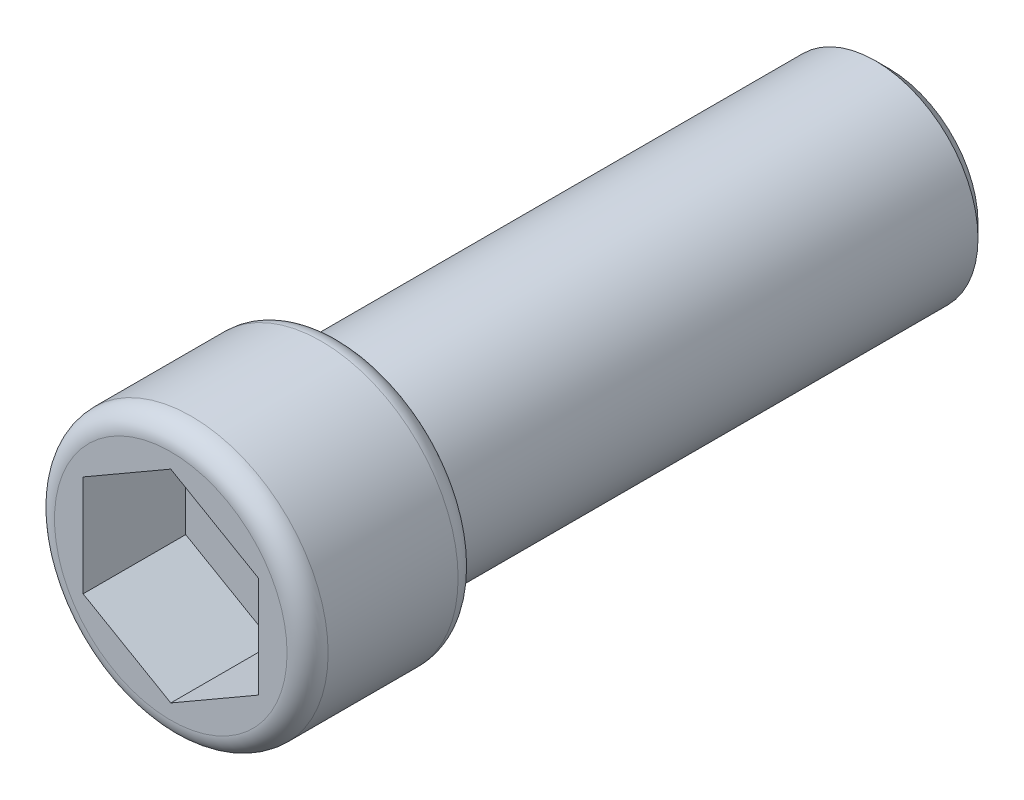
ISO-10303-21;
HEADER;
FILE_DESCRIPTION(('STEP AP214'),'2;1');
FILE_NAME('part.step','',(''),(''),'','','');
FILE_SCHEMA(('AUTOMOTIVE_DESIGN { 1 0 10303 214 1 1 1 1 }'));
ENDSEC;
DATA;
#1=APPLICATION_CONTEXT('core data for automotive mechanical design processes');
#2=APPLICATION_PROTOCOL_DEFINITION('international standard','automotive_design',2000,#1);
#3=PRODUCT_CONTEXT('',#1,'mechanical');
#4=PRODUCT('Part','Part','',(#3));
#5=PRODUCT_RELATED_PRODUCT_CATEGORY('part','',(#4));
#6=PRODUCT_DEFINITION_FORMATION('','',#4);
#7=PRODUCT_DEFINITION_CONTEXT('part definition',#1,'design');
#8=PRODUCT_DEFINITION('design','',#6,#7);
#9=PRODUCT_DEFINITION_SHAPE('','',#8);
#10=(LENGTH_UNIT() NAMED_UNIT(*) SI_UNIT(.MILLI.,.METRE.));
#11=(NAMED_UNIT(*) PLANE_ANGLE_UNIT() SI_UNIT($,.RADIAN.));
#12=(NAMED_UNIT(*) SI_UNIT($,.STERADIAN.) SOLID_ANGLE_UNIT());
#13=UNCERTAINTY_MEASURE_WITH_UNIT(LENGTH_MEASURE(1.E-05),#10,'distance_accuracy_value','');
#14=(GEOMETRIC_REPRESENTATION_CONTEXT(3) GLOBAL_UNCERTAINTY_ASSIGNED_CONTEXT((#13)) GLOBAL_UNIT_ASSIGNED_CONTEXT((#10,
#11,#12)) REPRESENTATION_CONTEXT('',''));
#15=CARTESIAN_POINT('',(0.,0.,0.));
#16=DIRECTION('',(0.,0.,1.));
#17=DIRECTION('',(1.,0.,0.));
#18=AXIS2_PLACEMENT_3D('',#15,#16,#17);
#19=CARTESIAN_POINT('',(0.,0.,8.));
#20=DIRECTION('',(0.,0.,-1.));
#21=DIRECTION('',(-1.,0.,0.));
#22=AXIS2_PLACEMENT_3D('',#19,#20,#21);
#23=CYLINDRICAL_SURFACE('',#22,1.5);
#24=CARTESIAN_POINT('',(0.,0.,0.2));
#25=DIRECTION('',(0.,0.,1.));
#26=DIRECTION('',(1.,0.,0.));
#27=AXIS2_PLACEMENT_3D('',#24,#25,#26);
#28=CIRCLE('',#27,1.5);
#29=CARTESIAN_POINT('',(1.5,0.,0.2));
#30=VERTEX_POINT('',#29);
#31=EDGE_CURVE('E50',#30,#30,#28,.T.);
#32=ORIENTED_EDGE('',*,*,#31,.T.);
#33=EDGE_LOOP('',(#32));
#34=FACE_BOUND('',#33,.T.);
#35=CARTESIAN_POINT('',(0.,0.,8.));
#36=DIRECTION('',(0.,0.,1.));
#37=DIRECTION('',(1.,0.,0.));
#38=AXIS2_PLACEMENT_3D('',#35,#36,#37);
#39=CIRCLE('',#38,1.5);
#40=CARTESIAN_POINT('',(1.5,0.,8.));
#41=VERTEX_POINT('',#40);
#42=EDGE_CURVE('E156',#41,#41,#39,.T.);
#43=ORIENTED_EDGE('',*,*,#42,.F.);
#44=EDGE_LOOP('',(#43));
#45=FACE_BOUND('',#44,.T.);
#46=ADVANCED_FACE('F41',(#34,#45),#23,.T.);
#47=CARTESIAN_POINT('',(0.,0.,0.));
#48=DIRECTION('',(0.,0.,1.));
#49=DIRECTION('',(1.,0.,0.));
#50=AXIS2_PLACEMENT_3D('',#47,#48,#49);
#51=PLANE('',#50);
#52=CARTESIAN_POINT('',(0.,0.,0.));
#53=DIRECTION('',(0.,0.,1.));
#54=DIRECTION('',(1.,0.,0.));
#55=AXIS2_PLACEMENT_3D('',#52,#53,#54);
#56=CIRCLE('',#55,1.3);
#57=CARTESIAN_POINT('',(1.3,0.,0.));
#58=VERTEX_POINT('',#57);
#59=EDGE_CURVE('E11',#58,#58,#56,.F.);
#60=ORIENTED_EDGE('',*,*,#59,.T.);
#61=EDGE_LOOP('',(#60));
#62=FACE_BOUND('',#61,.T.);
#63=ADVANCED_FACE('F200',(#62),#51,.F.);
#64=CARTESIAN_POINT('',(0.,0.,10.5));
#65=DIRECTION('',(0.,0.,-1.));
#66=DIRECTION('',(-1.,0.,0.));
#67=AXIS2_PLACEMENT_3D('',#64,#65,#66);
#68=CYLINDRICAL_SURFACE('',#67,2.);
#69=CARTESIAN_POINT('',(0.,0.,8.3));
#70=DIRECTION('',(0.,0.,1.));
#71=DIRECTION('',(1.,0.,0.));
#72=AXIS2_PLACEMENT_3D('',#69,#70,#71);
#73=CIRCLE('',#72,2.);
#74=CARTESIAN_POINT('',(2.,0.,8.3));
#75=VERTEX_POINT('',#74);
#76=EDGE_CURVE('E173',#75,#75,#73,.T.);
#77=ORIENTED_EDGE('',*,*,#76,.T.);
#78=EDGE_LOOP('',(#77));
#79=FACE_BOUND('',#78,.T.);
#80=CARTESIAN_POINT('',(0.,0.,10.2));
#81=DIRECTION('',(0.,0.,1.));
#82=DIRECTION('',(1.,0.,0.));
#83=AXIS2_PLACEMENT_3D('',#80,#81,#82);
#84=CIRCLE('',#83,2.);
#85=CARTESIAN_POINT('',(2.,0.,10.2));
#86=VERTEX_POINT('',#85);
#87=EDGE_CURVE('E169',#86,#86,#84,.F.);
#88=ORIENTED_EDGE('',*,*,#87,.T.);
#89=EDGE_LOOP('',(#88));
#90=FACE_BOUND('',#89,.T.);
#91=ADVANCED_FACE('F205',(#79,#90),#68,.T.);
#92=CARTESIAN_POINT('',(0.,0.,10.5));
#93=DIRECTION('',(0.,0.,1.));
#94=DIRECTION('',(1.,0.,0.));
#95=AXIS2_PLACEMENT_3D('',#92,#93,#94);
#96=PLANE('',#95);
#97=CARTESIAN_POINT('',(0.,0.,10.5));
#98=DIRECTION('',(0.,0.,1.));
#99=DIRECTION('',(1.,0.,0.));
#100=AXIS2_PLACEMENT_3D('',#97,#98,#99);
#101=CIRCLE('',#100,1.7);
#102=CARTESIAN_POINT('',(1.7,0.,10.5));
#103=VERTEX_POINT('',#102);
#104=EDGE_CURVE('E181',#103,#103,#101,.T.);
#105=ORIENTED_EDGE('',*,*,#104,.T.);
#106=EDGE_LOOP('',(#105));
#107=FACE_BOUND('',#106,.T.);
#108=DIRECTION('',(-0.866025403784442,0.499999999999995,0.));
#109=VECTOR('',#108,1.);
#110=CARTESIAN_POINT('',(1.28177031464721,0.740030436200855,10.5));
#111=LINE('',#110,#109);
#112=CARTESIAN_POINT('',(1.28177031464721,0.740030436200855,10.5));
#113=VERTEX_POINT('',#112);
#114=CARTESIAN_POINT('',(0.,1.48006087240168,10.5));
#115=VERTEX_POINT('',#114);
#116=EDGE_CURVE('E57',#113,#115,#111,.T.);
#117=ORIENTED_EDGE('',*,*,#116,.F.);
#118=DIRECTION('',(0.,1.,0.));
#119=VECTOR('',#118,1.);
#120=CARTESIAN_POINT('',(1.28177031464722,-0.740030436200828,10.5));
#121=LINE('',#120,#119);
#122=CARTESIAN_POINT('',(1.28177031464722,-0.740030436200828,10.5));
#123=VERTEX_POINT('',#122);
#124=EDGE_CURVE('E150',#123,#113,#121,.T.);
#125=ORIENTED_EDGE('',*,*,#124,.F.);
#126=DIRECTION('',(0.866025403784435,0.500000000000007,0.));
#127=VECTOR('',#126,1.);
#128=CARTESIAN_POINT('',(0.,-1.48006087240168,10.5));
#129=LINE('',#128,#127);
#130=CARTESIAN_POINT('',(0.,-1.48006087240168,10.5));
#131=VERTEX_POINT('',#130);
#132=EDGE_CURVE('E147',#131,#123,#129,.T.);
#133=ORIENTED_EDGE('',*,*,#132,.F.);
#134=DIRECTION('',(0.866025403784442,-0.499999999999995,0.));
#135=VECTOR('',#134,1.);
#136=CARTESIAN_POINT('',(-1.28177031464721,-0.740030436200846,10.5));
#137=LINE('',#136,#135);
#138=CARTESIAN_POINT('',(-1.28177031464721,-0.740030436200846,10.5));
#139=VERTEX_POINT('',#138);
#140=EDGE_CURVE('E105',#139,#131,#137,.T.);
#141=ORIENTED_EDGE('',*,*,#140,.F.);
#142=DIRECTION('',(0.,-1.,0.));
#143=VECTOR('',#142,1.);
#144=CARTESIAN_POINT('',(-1.28177031464722,0.740030436200837,10.5));
#145=LINE('',#144,#143);
#146=CARTESIAN_POINT('',(-1.28177031464722,0.740030436200837,10.5));
#147=VERTEX_POINT('',#146);
#148=EDGE_CURVE('E141',#147,#139,#145,.T.);
#149=ORIENTED_EDGE('',*,*,#148,.F.);
#150=DIRECTION('',(-0.866025403784438,-0.500000000000001,0.));
#151=VECTOR('',#150,1.);
#152=CARTESIAN_POINT('',(0.,1.48006087240168,10.5));
#153=LINE('',#152,#151);
#154=EDGE_CURVE('E137',#115,#147,#153,.T.);
#155=ORIENTED_EDGE('',*,*,#154,.F.);
#156=EDGE_LOOP('',(#117,#125,#133,#141,#149,#155));
#157=FACE_BOUND('',#156,.T.);
#158=ADVANCED_FACE('F223',(#107,#157),#96,.T.);
#159=CARTESIAN_POINT('',(0.,0.,8.));
#160=DIRECTION('',(0.,0.,1.));
#161=DIRECTION('',(1.,0.,0.));
#162=AXIS2_PLACEMENT_3D('',#159,#160,#161);
#163=PLANE('',#162);
#164=CARTESIAN_POINT('',(0.,0.,8.));
#165=DIRECTION('',(0.,0.,1.));
#166=DIRECTION('',(1.,0.,0.));
#167=AXIS2_PLACEMENT_3D('',#164,#165,#166);
#168=CIRCLE('',#167,1.7);
#169=CARTESIAN_POINT('',(1.7,0.,8.));
#170=VERTEX_POINT('',#169);
#171=EDGE_CURVE('E177',#170,#170,#168,.F.);
#172=ORIENTED_EDGE('',*,*,#171,.T.);
#173=EDGE_LOOP('',(#172));
#174=FACE_BOUND('',#173,.T.);
#175=ORIENTED_EDGE('',*,*,#42,.T.);
#176=EDGE_LOOP('',(#175));
#177=FACE_BOUND('',#176,.T.);
#178=ADVANCED_FACE('F230',(#174,#177),#163,.F.);
#179=CARTESIAN_POINT('',(1.28177031464721,0.740030436200855,9.));
#180=DIRECTION('',(0.499999999999995,0.866025403784441,0.));
#181=DIRECTION('',(-0.866025403784442,0.499999999999995,0.));
#182=AXIS2_PLACEMENT_3D('',#179,#180,#181);
#183=PLANE('',#182);
#184=ORIENTED_EDGE('',*,*,#116,.T.);
#185=DIRECTION('',(0.,0.,1.));
#186=VECTOR('',#185,1.);
#187=CARTESIAN_POINT('',(0.,1.48006087240168,9.));
#188=LINE('',#187,#186);
#189=CARTESIAN_POINT('',(0.,1.48006087240168,9.));
#190=VERTEX_POINT('',#189);
#191=EDGE_CURVE('E87',#190,#115,#188,.T.);
#192=ORIENTED_EDGE('',*,*,#191,.F.);
#193=DIRECTION('',(-0.866025403784442,0.499999999999995,0.));
#194=VECTOR('',#193,1.);
#195=CARTESIAN_POINT('',(1.28177031464721,0.740030436200855,9.));
#196=LINE('',#195,#194);
#197=CARTESIAN_POINT('',(1.28177031464721,0.740030436200855,9.));
#198=VERTEX_POINT('',#197);
#199=EDGE_CURVE('E153',#198,#190,#196,.T.);
#200=ORIENTED_EDGE('',*,*,#199,.F.);
#201=DIRECTION('',(0.,0.,1.));
#202=VECTOR('',#201,1.);
#203=CARTESIAN_POINT('',(1.28177031464721,0.740030436200855,9.));
#204=LINE('',#203,#202);
#205=EDGE_CURVE('E65',#198,#113,#204,.T.);
#206=ORIENTED_EDGE('',*,*,#205,.T.);
#207=EDGE_LOOP('',(#184,#192,#200,#206));
#208=FACE_BOUND('',#207,.T.);
#209=ADVANCED_FACE('F239',(#208),#183,.F.);
#210=CARTESIAN_POINT('',(1.28177031464722,-0.740030436200828,9.));
#211=DIRECTION('',(1.,0.,0.));
#212=DIRECTION('',(0.,1.,0.));
#213=AXIS2_PLACEMENT_3D('',#210,#211,#212);
#214=PLANE('',#213);
#215=ORIENTED_EDGE('',*,*,#124,.T.);
#216=ORIENTED_EDGE('',*,*,#205,.F.);
#217=DIRECTION('',(0.,1.,0.));
#218=VECTOR('',#217,1.);
#219=CARTESIAN_POINT('',(1.28177031464722,-0.740030436200828,9.));
#220=LINE('',#219,#218);
#221=CARTESIAN_POINT('',(1.28177031464722,-0.740030436200828,9.));
#222=VERTEX_POINT('',#221);
#223=EDGE_CURVE('E119',#222,#198,#220,.T.);
#224=ORIENTED_EDGE('',*,*,#223,.F.);
#225=DIRECTION('',(0.,0.,1.));
#226=VECTOR('',#225,1.);
#227=CARTESIAN_POINT('',(1.28177031464722,-0.740030436200828,9.));
#228=LINE('',#227,#226);
#229=EDGE_CURVE('E110',#222,#123,#228,.T.);
#230=ORIENTED_EDGE('',*,*,#229,.T.);
#231=EDGE_LOOP('',(#215,#216,#224,#230));
#232=FACE_BOUND('',#231,.T.);
#233=ADVANCED_FACE('F241',(#232),#214,.F.);
#234=CARTESIAN_POINT('',(0.,-1.48006087240168,9.));
#235=DIRECTION('',(0.500000000000007,-0.866025403784434,0.));
#236=DIRECTION('',(0.866025403784435,0.500000000000007,0.));
#237=AXIS2_PLACEMENT_3D('',#234,#235,#236);
#238=PLANE('',#237);
#239=ORIENTED_EDGE('',*,*,#132,.T.);
#240=ORIENTED_EDGE('',*,*,#229,.F.);
#241=DIRECTION('',(0.866025403784435,0.500000000000007,0.));
#242=VECTOR('',#241,1.);
#243=CARTESIAN_POINT('',(0.,-1.48006087240168,9.));
#244=LINE('',#243,#242);
#245=CARTESIAN_POINT('',(0.,-1.48006087240168,9.));
#246=VERTEX_POINT('',#245);
#247=EDGE_CURVE('E114',#246,#222,#244,.T.);
#248=ORIENTED_EDGE('',*,*,#247,.F.);
#249=DIRECTION('',(0.,0.,1.));
#250=VECTOR('',#249,1.);
#251=CARTESIAN_POINT('',(0.,-1.48006087240168,9.));
#252=LINE('',#251,#250);
#253=EDGE_CURVE('E98',#246,#131,#252,.T.);
#254=ORIENTED_EDGE('',*,*,#253,.T.);
#255=EDGE_LOOP('',(#239,#240,#248,#254));
#256=FACE_BOUND('',#255,.T.);
#257=ADVANCED_FACE('F115',(#256),#238,.F.);
#258=CARTESIAN_POINT('',(-1.28177031464721,-0.740030436200846,9.));
#259=DIRECTION('',(-0.499999999999995,-0.866025403784441,0.));
#260=DIRECTION('',(0.866025403784442,-0.499999999999995,0.));
#261=AXIS2_PLACEMENT_3D('',#258,#259,#260);
#262=PLANE('',#261);
#263=ORIENTED_EDGE('',*,*,#140,.T.);
#264=ORIENTED_EDGE('',*,*,#253,.F.);
#265=DIRECTION('',(0.866025403784442,-0.499999999999995,0.));
#266=VECTOR('',#265,1.);
#267=CARTESIAN_POINT('',(-1.28177031464721,-0.740030436200846,9.));
#268=LINE('',#267,#266);
#269=CARTESIAN_POINT('',(-1.28177031464721,-0.740030436200846,9.));
#270=VERTEX_POINT('',#269);
#271=EDGE_CURVE('E102',#270,#246,#268,.T.);
#272=ORIENTED_EDGE('',*,*,#271,.F.);
#273=DIRECTION('',(0.,0.,1.));
#274=VECTOR('',#273,1.);
#275=CARTESIAN_POINT('',(-1.28177031464721,-0.740030436200846,9.));
#276=LINE('',#275,#274);
#277=EDGE_CURVE('E111',#270,#139,#276,.T.);
#278=ORIENTED_EDGE('',*,*,#277,.T.);
#279=EDGE_LOOP('',(#263,#264,#272,#278));
#280=FACE_BOUND('',#279,.T.);
#281=ADVANCED_FACE('F100',(#280),#262,.F.);
#282=CARTESIAN_POINT('',(-1.28177031464722,0.740030436200837,9.));
#283=DIRECTION('',(-1.,0.,0.));
#284=DIRECTION('',(0.,-1.,0.));
#285=AXIS2_PLACEMENT_3D('',#282,#283,#284);
#286=PLANE('',#285);
#287=ORIENTED_EDGE('',*,*,#148,.T.);
#288=ORIENTED_EDGE('',*,*,#277,.F.);
#289=DIRECTION('',(0.,-1.,0.));
#290=VECTOR('',#289,1.);
#291=CARTESIAN_POINT('',(-1.28177031464722,0.740030436200837,9.));
#292=LINE('',#291,#290);
#293=CARTESIAN_POINT('',(-1.28177031464722,0.740030436200837,9.));
#294=VERTEX_POINT('',#293);
#295=EDGE_CURVE('E125',#294,#270,#292,.T.);
#296=ORIENTED_EDGE('',*,*,#295,.F.);
#297=DIRECTION('',(0.,0.,1.));
#298=VECTOR('',#297,1.);
#299=CARTESIAN_POINT('',(-1.28177031464722,0.740030436200837,9.));
#300=LINE('',#299,#298);
#301=EDGE_CURVE('E161',#294,#147,#300,.T.);
#302=ORIENTED_EDGE('',*,*,#301,.T.);
#303=EDGE_LOOP('',(#287,#288,#296,#302));
#304=FACE_BOUND('',#303,.T.);
#305=ADVANCED_FACE('F253',(#304),#286,.F.);
#306=CARTESIAN_POINT('',(0.,1.48006087240168,9.));
#307=DIRECTION('',(-0.500000000000001,0.866025403784438,0.));
#308=DIRECTION('',(-0.866025403784438,-0.500000000000001,0.));
#309=AXIS2_PLACEMENT_3D('',#306,#307,#308);
#310=PLANE('',#309);
#311=ORIENTED_EDGE('',*,*,#154,.T.);
#312=ORIENTED_EDGE('',*,*,#301,.F.);
#313=DIRECTION('',(-0.866025403784438,-0.500000000000001,0.));
#314=VECTOR('',#313,1.);
#315=CARTESIAN_POINT('',(0.,1.48006087240168,9.));
#316=LINE('',#315,#314);
#317=EDGE_CURVE('E129',#190,#294,#316,.T.);
#318=ORIENTED_EDGE('',*,*,#317,.F.);
#319=ORIENTED_EDGE('',*,*,#191,.T.);
#320=EDGE_LOOP('',(#311,#312,#318,#319));
#321=FACE_BOUND('',#320,.T.);
#322=ADVANCED_FACE('F215',(#321),#310,.F.);
#323=CARTESIAN_POINT('',(0.,0.,9.));
#324=DIRECTION('',(0.,0.,1.));
#325=DIRECTION('',(1.,0.,0.));
#326=AXIS2_PLACEMENT_3D('',#323,#324,#325);
#327=PLANE('',#326);
#328=ORIENTED_EDGE('',*,*,#199,.T.);
#329=ORIENTED_EDGE('',*,*,#317,.T.);
#330=ORIENTED_EDGE('',*,*,#295,.T.);
#331=ORIENTED_EDGE('',*,*,#271,.T.);
#332=ORIENTED_EDGE('',*,*,#247,.T.);
#333=ORIENTED_EDGE('',*,*,#223,.T.);
#334=EDGE_LOOP('',(#328,#329,#330,#331,#332,#333));
#335=FACE_BOUND('',#334,.T.);
#336=ADVANCED_FACE('F122',(#335),#327,.T.);
#337=CARTESIAN_POINT('',(0.,0.,8.3));
#338=DIRECTION('',(0.,0.,1.));
#339=DIRECTION('',(1.,0.,0.));
#340=AXIS2_PLACEMENT_3D('',#337,#338,#339);
#341=TOROIDAL_SURFACE('',#340,1.7,0.3);
#342=ORIENTED_EDGE('',*,*,#171,.F.);
#343=EDGE_LOOP('',(#342));
#344=FACE_BOUND('',#343,.T.);
#345=ORIENTED_EDGE('',*,*,#76,.F.);
#346=EDGE_LOOP('',(#345));
#347=FACE_BOUND('',#346,.T.);
#348=ADVANCED_FACE('F196',(#344,#347),#341,.T.);
#349=CARTESIAN_POINT('',(0.,0.,10.2));
#350=DIRECTION('',(0.,0.,1.));
#351=DIRECTION('',(1.,0.,0.));
#352=AXIS2_PLACEMENT_3D('',#349,#350,#351);
#353=TOROIDAL_SURFACE('',#352,1.7,0.3);
#354=ORIENTED_EDGE('',*,*,#87,.F.);
#355=EDGE_LOOP('',(#354));
#356=FACE_BOUND('',#355,.T.);
#357=ORIENTED_EDGE('',*,*,#104,.F.);
#358=EDGE_LOOP('',(#357));
#359=FACE_BOUND('',#358,.T.);
#360=ADVANCED_FACE('F191',(#356,#359),#353,.T.);
#361=CARTESIAN_POINT('',(0.,0.,0.2));
#362=DIRECTION('',(0.,0.,1.));
#363=DIRECTION('',(1.,0.,0.));
#364=AXIS2_PLACEMENT_3D('',#361,#362,#363);
#365=CONICAL_SURFACE('',#364,1.5,0.78539816339745);
#366=ORIENTED_EDGE('',*,*,#59,.F.);
#367=EDGE_LOOP('',(#366));
#368=FACE_BOUND('',#367,.T.);
#369=ORIENTED_EDGE('',*,*,#31,.F.);
#370=EDGE_LOOP('',(#369));
#371=FACE_BOUND('',#370,.T.);
#372=ADVANCED_FACE('F43',(#368,#371),#365,.T.);
#373=CLOSED_SHELL('',(#46,#63,#91,#158,#178,#209,#233,#257,#281,#305,#322,#336,#348,#360,#372));
#374=MANIFOLD_SOLID_BREP('B2',#373);
#375=ADVANCED_BREP_SHAPE_REPRESENTATION('',(#18,#374),#14);
#376=SHAPE_DEFINITION_REPRESENTATION(#9,#375);
ENDSEC;
END-ISO-10303-21;
